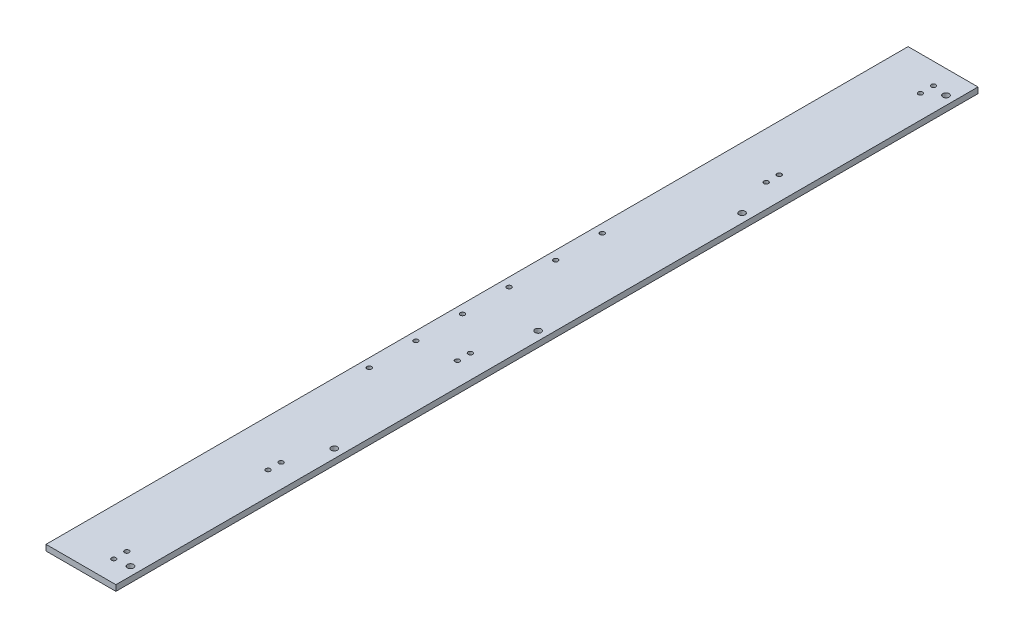
ISO-10303-21;
HEADER;
FILE_DESCRIPTION(('STEP AP214'),'2;1');
FILE_NAME('part.step','',(''),(''),'','','');
FILE_SCHEMA(('AUTOMOTIVE_DESIGN { 1 0 10303 214 1 1 1 1 }'));
ENDSEC;
DATA;
#1=APPLICATION_CONTEXT('core data for automotive mechanical design processes');
#2=APPLICATION_PROTOCOL_DEFINITION('international standard','automotive_design',2000,#1);
#3=PRODUCT_CONTEXT('',#1,'mechanical');
#4=PRODUCT('Part','Part','',(#3));
#5=PRODUCT_RELATED_PRODUCT_CATEGORY('part','',(#4));
#6=PRODUCT_DEFINITION_FORMATION('','',#4);
#7=PRODUCT_DEFINITION_CONTEXT('part definition',#1,'design');
#8=PRODUCT_DEFINITION('design','',#6,#7);
#9=PRODUCT_DEFINITION_SHAPE('','',#8);
#10=(LENGTH_UNIT() NAMED_UNIT(*) SI_UNIT(.MILLI.,.METRE.));
#11=(NAMED_UNIT(*) PLANE_ANGLE_UNIT() SI_UNIT($,.RADIAN.));
#12=(NAMED_UNIT(*) SI_UNIT($,.STERADIAN.) SOLID_ANGLE_UNIT());
#13=UNCERTAINTY_MEASURE_WITH_UNIT(LENGTH_MEASURE(1.E-05),#10,'distance_accuracy_value','');
#14=(GEOMETRIC_REPRESENTATION_CONTEXT(3) GLOBAL_UNCERTAINTY_ASSIGNED_CONTEXT((#13)) GLOBAL_UNIT_ASSIGNED_CONTEXT((#10,
#11,#12)) REPRESENTATION_CONTEXT('',''));
#15=CARTESIAN_POINT('',(0.,0.,0.));
#16=DIRECTION('',(0.,0.,1.));
#17=DIRECTION('',(1.,0.,0.));
#18=AXIS2_PLACEMENT_3D('',#15,#16,#17);
#19=CARTESIAN_POINT('',(9.525,0.,342.9));
#20=DIRECTION('',(0.,1.,0.));
#21=DIRECTION('',(0.,0.,1.));
#22=AXIS2_PLACEMENT_3D('',#19,#20,#21);
#23=CYLINDRICAL_SURFACE('',#22,2.4638);
#24=CARTESIAN_POINT('',(9.525,0.,342.9));
#25=DIRECTION('',(0.,1.,0.));
#26=DIRECTION('',(0.,0.,1.));
#27=AXIS2_PLACEMENT_3D('',#24,#25,#26);
#28=CIRCLE('',#27,2.4638);
#29=CARTESIAN_POINT('',(9.525,0.,345.3638));
#30=VERTEX_POINT('',#29);
#31=EDGE_CURVE('E46',#30,#30,#28,.T.);
#32=ORIENTED_EDGE('',*,*,#31,.F.);
#33=EDGE_LOOP('',(#32));
#34=FACE_BOUND('',#33,.T.);
#35=CARTESIAN_POINT('',(9.525,6.35,342.9));
#36=DIRECTION('',(0.,1.,0.));
#37=DIRECTION('',(0.,0.,1.));
#38=AXIS2_PLACEMENT_3D('',#35,#36,#37);
#39=CIRCLE('',#38,2.4638);
#40=CARTESIAN_POINT('',(9.525,6.35,345.3638));
#41=VERTEX_POINT('',#40);
#42=EDGE_CURVE('E11',#41,#41,#39,.T.);
#43=ORIENTED_EDGE('',*,*,#42,.T.);
#44=EDGE_LOOP('',(#43));
#45=FACE_BOUND('',#44,.T.);
#46=ADVANCED_FACE('F37',(#34,#45),#23,.F.);
#47=CARTESIAN_POINT('',(9.525,0.,393.7));
#48=DIRECTION('',(0.,1.,0.));
#49=DIRECTION('',(0.,0.,1.));
#50=AXIS2_PLACEMENT_3D('',#47,#48,#49);
#51=CYLINDRICAL_SURFACE('',#50,2.4638);
#52=CARTESIAN_POINT('',(9.525,0.,393.7));
#53=DIRECTION('',(0.,1.,0.));
#54=DIRECTION('',(0.,0.,1.));
#55=AXIS2_PLACEMENT_3D('',#52,#53,#54);
#56=CIRCLE('',#55,2.4638);
#57=CARTESIAN_POINT('',(9.525,0.,396.1638));
#58=VERTEX_POINT('',#57);
#59=EDGE_CURVE('E129',#58,#58,#56,.T.);
#60=ORIENTED_EDGE('',*,*,#59,.F.);
#61=EDGE_LOOP('',(#60));
#62=FACE_BOUND('',#61,.T.);
#63=CARTESIAN_POINT('',(9.525,6.35,393.7));
#64=DIRECTION('',(0.,1.,0.));
#65=DIRECTION('',(0.,0.,1.));
#66=AXIS2_PLACEMENT_3D('',#63,#64,#65);
#67=CIRCLE('',#66,2.4638);
#68=CARTESIAN_POINT('',(9.525,6.35,396.1638));
#69=VERTEX_POINT('',#68);
#70=EDGE_CURVE('E132',#69,#69,#67,.T.);
#71=ORIENTED_EDGE('',*,*,#70,.T.);
#72=EDGE_LOOP('',(#71));
#73=FACE_BOUND('',#72,.T.);
#74=ADVANCED_FACE('F228',(#62,#73),#51,.F.);
#75=CARTESIAN_POINT('',(9.525,0.,444.5));
#76=DIRECTION('',(0.,1.,0.));
#77=DIRECTION('',(0.,0.,1.));
#78=AXIS2_PLACEMENT_3D('',#75,#76,#77);
#79=CYLINDRICAL_SURFACE('',#78,2.4638);
#80=CARTESIAN_POINT('',(9.525,0.,444.5));
#81=DIRECTION('',(0.,1.,0.));
#82=DIRECTION('',(0.,0.,1.));
#83=AXIS2_PLACEMENT_3D('',#80,#81,#82);
#84=CIRCLE('',#83,2.4638);
#85=CARTESIAN_POINT('',(9.525,0.,446.9638));
#86=VERTEX_POINT('',#85);
#87=EDGE_CURVE('E123',#86,#86,#84,.T.);
#88=ORIENTED_EDGE('',*,*,#87,.F.);
#89=EDGE_LOOP('',(#88));
#90=FACE_BOUND('',#89,.T.);
#91=CARTESIAN_POINT('',(9.525,6.35,444.5));
#92=DIRECTION('',(0.,1.,0.));
#93=DIRECTION('',(0.,0.,1.));
#94=AXIS2_PLACEMENT_3D('',#91,#92,#93);
#95=CIRCLE('',#94,2.4638);
#96=CARTESIAN_POINT('',(9.525,6.35,446.9638));
#97=VERTEX_POINT('',#96);
#98=EDGE_CURVE('E126',#97,#97,#95,.T.);
#99=ORIENTED_EDGE('',*,*,#98,.T.);
#100=EDGE_LOOP('',(#99));
#101=FACE_BOUND('',#100,.T.);
#102=ADVANCED_FACE('F233',(#90,#101),#79,.F.);
#103=CARTESIAN_POINT('',(9.525,0.,495.3));
#104=DIRECTION('',(0.,1.,0.));
#105=DIRECTION('',(0.,0.,1.));
#106=AXIS2_PLACEMENT_3D('',#103,#104,#105);
#107=CYLINDRICAL_SURFACE('',#106,2.4638);
#108=CARTESIAN_POINT('',(9.525,0.,495.3));
#109=DIRECTION('',(0.,1.,0.));
#110=DIRECTION('',(0.,0.,1.));
#111=AXIS2_PLACEMENT_3D('',#108,#109,#110);
#112=CIRCLE('',#111,2.4638);
#113=CARTESIAN_POINT('',(9.525,0.,497.7638));
#114=VERTEX_POINT('',#113);
#115=EDGE_CURVE('E117',#114,#114,#112,.T.);
#116=ORIENTED_EDGE('',*,*,#115,.F.);
#117=EDGE_LOOP('',(#116));
#118=FACE_BOUND('',#117,.T.);
#119=CARTESIAN_POINT('',(9.525,6.35,495.3));
#120=DIRECTION('',(0.,1.,0.));
#121=DIRECTION('',(0.,0.,1.));
#122=AXIS2_PLACEMENT_3D('',#119,#120,#121);
#123=CIRCLE('',#122,2.4638);
#124=CARTESIAN_POINT('',(9.525,6.35,497.7638));
#125=VERTEX_POINT('',#124);
#126=EDGE_CURVE('E120',#125,#125,#123,.T.);
#127=ORIENTED_EDGE('',*,*,#126,.T.);
#128=EDGE_LOOP('',(#127));
#129=FACE_BOUND('',#128,.T.);
#130=ADVANCED_FACE('F246',(#118,#129),#107,.F.);
#131=CARTESIAN_POINT('',(0.,0.,939.8));
#132=DIRECTION('',(1.,0.,0.));
#133=DIRECTION('',(0.,0.,-1.));
#134=AXIS2_PLACEMENT_3D('',#131,#132,#133);
#135=PLANE('',#134);
#136=DIRECTION('',(0.,-1.,0.));
#137=VECTOR('',#136,1.);
#138=CARTESIAN_POINT('',(0.,0.,0.));
#139=LINE('',#138,#137);
#140=CARTESIAN_POINT('',(0.,6.35,0.));
#141=VERTEX_POINT('',#140);
#142=CARTESIAN_POINT('',(0.,0.,0.));
#143=VERTEX_POINT('',#142);
#144=EDGE_CURVE('E107',#141,#143,#139,.T.);
#145=ORIENTED_EDGE('',*,*,#144,.T.);
#146=DIRECTION('',(0.,0.,-1.));
#147=VECTOR('',#146,1.);
#148=CARTESIAN_POINT('',(0.,0.,939.8));
#149=LINE('',#148,#147);
#150=CARTESIAN_POINT('',(0.,0.,939.8));
#151=VERTEX_POINT('',#150);
#152=EDGE_CURVE('E98',#151,#143,#149,.T.);
#153=ORIENTED_EDGE('',*,*,#152,.F.);
#154=DIRECTION('',(0.,-1.,0.));
#155=VECTOR('',#154,1.);
#156=CARTESIAN_POINT('',(0.,0.,939.8));
#157=LINE('',#156,#155);
#158=CARTESIAN_POINT('',(0.,6.35,939.8));
#159=VERTEX_POINT('',#158);
#160=EDGE_CURVE('E91',#159,#151,#157,.T.);
#161=ORIENTED_EDGE('',*,*,#160,.F.);
#162=DIRECTION('',(0.,0.,-1.));
#163=VECTOR('',#162,1.);
#164=CARTESIAN_POINT('',(0.,6.35,939.8));
#165=LINE('',#164,#163);
#166=EDGE_CURVE('E103',#159,#141,#165,.T.);
#167=ORIENTED_EDGE('',*,*,#166,.T.);
#168=EDGE_LOOP('',(#145,#153,#161,#167));
#169=FACE_BOUND('',#168,.T.);
#170=ADVANCED_FACE('F238',(#169),#135,.F.);
#171=CARTESIAN_POINT('',(0.,0.,939.8));
#172=DIRECTION('',(0.,1.,0.));
#173=DIRECTION('',(0.,0.,1.));
#174=AXIS2_PLACEMENT_3D('',#171,#172,#173);
#175=PLANE('',#174);
#176=CARTESIAN_POINT('',(66.6750000000046,0.,914.4));
#177=DIRECTION('',(0.,1.,0.));
#178=DIRECTION('',(0.,0.,1.));
#179=AXIS2_PLACEMENT_3D('',#176,#177,#178);
#180=CIRCLE('',#179,3.3655);
#181=CARTESIAN_POINT('',(66.6750000000046,0.,917.7655));
#182=VERTEX_POINT('',#181);
#183=EDGE_CURVE('E489',#182,#182,#180,.T.);
#184=ORIENTED_EDGE('',*,*,#183,.T.);
#185=EDGE_LOOP('',(#184));
#186=FACE_BOUND('',#185,.T.);
#187=CARTESIAN_POINT('',(66.6750000000022,0.,692.15));
#188=DIRECTION('',(0.,1.,0.));
#189=DIRECTION('',(0.,0.,1.));
#190=AXIS2_PLACEMENT_3D('',#187,#188,#189);
#191=CIRCLE('',#190,3.3655);
#192=CARTESIAN_POINT('',(66.6750000000022,0.,695.5155));
#193=VERTEX_POINT('',#192);
#194=EDGE_CURVE('E490',#193,#193,#191,.T.);
#195=ORIENTED_EDGE('',*,*,#194,.T.);
#196=EDGE_LOOP('',(#195));
#197=FACE_BOUND('',#196,.T.);
#198=CARTESIAN_POINT('',(66.6749999999984,0.,25.4));
#199=DIRECTION('',(0.,1.,0.));
#200=DIRECTION('',(0.,0.,1.));
#201=AXIS2_PLACEMENT_3D('',#198,#199,#200);
#202=CIRCLE('',#201,3.36549999999999);
#203=CARTESIAN_POINT('',(66.6749999999984,0.,28.7655));
#204=VERTEX_POINT('',#203);
#205=EDGE_CURVE('E493',#204,#204,#202,.T.);
#206=ORIENTED_EDGE('',*,*,#205,.T.);
#207=EDGE_LOOP('',(#206));
#208=FACE_BOUND('',#207,.T.);
#209=CARTESIAN_POINT('',(66.6749999999991,0.,247.65));
#210=DIRECTION('',(0.,1.,0.));
#211=DIRECTION('',(0.,0.,1.));
#212=AXIS2_PLACEMENT_3D('',#209,#210,#211);
#213=CIRCLE('',#212,3.36549999999999);
#214=CARTESIAN_POINT('',(66.6749999999991,0.,251.0155));
#215=VERTEX_POINT('',#214);
#216=EDGE_CURVE('E499',#215,#215,#213,.T.);
#217=ORIENTED_EDGE('',*,*,#216,.T.);
#218=EDGE_LOOP('',(#217));
#219=FACE_BOUND('',#218,.T.);
#220=CARTESIAN_POINT('',(66.6749999999999,0.,469.9));
#221=DIRECTION('',(0.,1.,0.));
#222=DIRECTION('',(0.,0.,1.));
#223=AXIS2_PLACEMENT_3D('',#220,#221,#222);
#224=CIRCLE('',#223,3.3655);
#225=CARTESIAN_POINT('',(66.6749999999999,0.,473.2655));
#226=VERTEX_POINT('',#225);
#227=EDGE_CURVE('E141',#226,#226,#224,.T.);
#228=ORIENTED_EDGE('',*,*,#227,.T.);
#229=EDGE_LOOP('',(#228));
#230=FACE_BOUND('',#229,.T.);
#231=CARTESIAN_POINT('',(50.8,0.,23.114));
#232=DIRECTION('',(0.,-1.,0.));
#233=DIRECTION('',(0.,0.,-1.));
#234=AXIS2_PLACEMENT_3D('',#231,#232,#233);
#235=CIRCLE('',#234,2.4638);
#236=CARTESIAN_POINT('',(50.8,0.,20.6502));
#237=VERTEX_POINT('',#236);
#238=EDGE_CURVE('E189',#237,#237,#235,.T.);
#239=ORIENTED_EDGE('',*,*,#238,.F.);
#240=EDGE_LOOP('',(#239));
#241=FACE_BOUND('',#240,.T.);
#242=CARTESIAN_POINT('',(50.8,0.,37.338));
#243=DIRECTION('',(0.,-1.,0.));
#244=DIRECTION('',(0.,0.,-1.));
#245=AXIS2_PLACEMENT_3D('',#242,#243,#244);
#246=CIRCLE('',#245,2.4638);
#247=CARTESIAN_POINT('',(50.8,0.,34.8742));
#248=VERTEX_POINT('',#247);
#249=EDGE_CURVE('E505',#248,#248,#246,.T.);
#250=ORIENTED_EDGE('',*,*,#249,.F.);
#251=EDGE_LOOP('',(#250));
#252=FACE_BOUND('',#251,.T.);
#253=CARTESIAN_POINT('',(50.8,0.,191.262));
#254=DIRECTION('',(0.,-1.,0.));
#255=DIRECTION('',(0.,0.,-1.));
#256=AXIS2_PLACEMENT_3D('',#253,#254,#255);
#257=CIRCLE('',#256,2.4638);
#258=CARTESIAN_POINT('',(50.8,0.,188.7982));
#259=VERTEX_POINT('',#258);
#260=EDGE_CURVE('E511',#259,#259,#257,.T.);
#261=ORIENTED_EDGE('',*,*,#260,.F.);
#262=EDGE_LOOP('',(#261));
#263=FACE_BOUND('',#262,.T.);
#264=CARTESIAN_POINT('',(50.8,0.,205.486));
#265=DIRECTION('',(0.,-1.,0.));
#266=DIRECTION('',(0.,0.,-1.));
#267=AXIS2_PLACEMENT_3D('',#264,#265,#266);
#268=CIRCLE('',#267,2.4638);
#269=CARTESIAN_POINT('',(50.8,0.,203.0222));
#270=VERTEX_POINT('',#269);
#271=EDGE_CURVE('E155',#270,#270,#268,.T.);
#272=ORIENTED_EDGE('',*,*,#271,.F.);
#273=EDGE_LOOP('',(#272));
#274=FACE_BOUND('',#273,.T.);
#275=CARTESIAN_POINT('',(50.8,0.,916.686));
#276=DIRECTION('',(0.,1.,0.));
#277=DIRECTION('',(0.,0.,1.));
#278=AXIS2_PLACEMENT_3D('',#275,#276,#277);
#279=CIRCLE('',#278,2.4638);
#280=CARTESIAN_POINT('',(50.8,0.,919.1498));
#281=VERTEX_POINT('',#280);
#282=EDGE_CURVE('E164',#281,#281,#279,.T.);
#283=ORIENTED_EDGE('',*,*,#282,.T.);
#284=EDGE_LOOP('',(#283));
#285=FACE_BOUND('',#284,.T.);
#286=CARTESIAN_POINT('',(50.8,0.,902.462));
#287=DIRECTION('',(0.,1.,0.));
#288=DIRECTION('',(0.,0.,1.));
#289=AXIS2_PLACEMENT_3D('',#286,#287,#288);
#290=CIRCLE('',#289,2.4638);
#291=CARTESIAN_POINT('',(50.8,0.,904.9258));
#292=VERTEX_POINT('',#291);
#293=EDGE_CURVE('E171',#292,#292,#290,.T.);
#294=ORIENTED_EDGE('',*,*,#293,.T.);
#295=EDGE_LOOP('',(#294));
#296=FACE_BOUND('',#295,.T.);
#297=CARTESIAN_POINT('',(50.8,0.,748.538));
#298=DIRECTION('',(0.,1.,0.));
#299=DIRECTION('',(0.,0.,1.));
#300=AXIS2_PLACEMENT_3D('',#297,#298,#299);
#301=CIRCLE('',#300,2.4638);
#302=CARTESIAN_POINT('',(50.8,0.,751.0018));
#303=VERTEX_POINT('',#302);
#304=EDGE_CURVE('E177',#303,#303,#301,.T.);
#305=ORIENTED_EDGE('',*,*,#304,.T.);
#306=EDGE_LOOP('',(#305));
#307=FACE_BOUND('',#306,.T.);
#308=CARTESIAN_POINT('',(50.8,0.,734.314));
#309=DIRECTION('',(0.,1.,0.));
#310=DIRECTION('',(0.,0.,1.));
#311=AXIS2_PLACEMENT_3D('',#308,#309,#310);
#312=CIRCLE('',#311,2.4638);
#313=CARTESIAN_POINT('',(50.8,0.,736.7778));
#314=VERTEX_POINT('',#313);
#315=EDGE_CURVE('E183',#314,#314,#312,.T.);
#316=ORIENTED_EDGE('',*,*,#315,.T.);
#317=EDGE_LOOP('',(#316));
#318=FACE_BOUND('',#317,.T.);
#319=CARTESIAN_POINT('',(50.8,0.,527.939));
#320=DIRECTION('',(0.,1.,0.));
#321=DIRECTION('',(0.,0.,1.));
#322=AXIS2_PLACEMENT_3D('',#319,#320,#321);
#323=CIRCLE('',#322,2.4638);
#324=CARTESIAN_POINT('',(50.8,0.,530.4028));
#325=VERTEX_POINT('',#324);
#326=EDGE_CURVE('E190',#325,#325,#323,.T.);
#327=ORIENTED_EDGE('',*,*,#326,.T.);
#328=EDGE_LOOP('',(#327));
#329=FACE_BOUND('',#328,.T.);
#330=CARTESIAN_POINT('',(50.8,0.,542.163));
#331=DIRECTION('',(0.,1.,0.));
#332=DIRECTION('',(0.,0.,1.));
#333=AXIS2_PLACEMENT_3D('',#330,#331,#332);
#334=CIRCLE('',#333,2.4638);
#335=CARTESIAN_POINT('',(50.8,0.,544.6268));
#336=VERTEX_POINT('',#335);
#337=EDGE_CURVE('E197',#336,#336,#334,.T.);
#338=ORIENTED_EDGE('',*,*,#337,.T.);
#339=EDGE_LOOP('',(#338));
#340=FACE_BOUND('',#339,.T.);
#341=CARTESIAN_POINT('',(9.525,0.,546.1));
#342=DIRECTION('',(0.,1.,0.));
#343=DIRECTION('',(0.,0.,1.));
#344=AXIS2_PLACEMENT_3D('',#341,#342,#343);
#345=CIRCLE('',#344,2.4638);
#346=CARTESIAN_POINT('',(9.525,0.,548.5638));
#347=VERTEX_POINT('',#346);
#348=EDGE_CURVE('E193',#347,#347,#345,.T.);
#349=ORIENTED_EDGE('',*,*,#348,.T.);
#350=EDGE_LOOP('',(#349));
#351=FACE_BOUND('',#350,.T.);
#352=CARTESIAN_POINT('',(9.525,0.,596.9));
#353=DIRECTION('',(0.,1.,0.));
#354=DIRECTION('',(0.,0.,1.));
#355=AXIS2_PLACEMENT_3D('',#352,#353,#354);
#356=CIRCLE('',#355,2.4638);
#357=CARTESIAN_POINT('',(9.525,0.,599.3638));
#358=VERTEX_POINT('',#357);
#359=EDGE_CURVE('E110',#358,#358,#356,.T.);
#360=ORIENTED_EDGE('',*,*,#359,.T.);
#361=EDGE_LOOP('',(#360));
#362=FACE_BOUND('',#361,.T.);
#363=DIRECTION('',(1.,0.,0.));
#364=VECTOR('',#363,1.);
#365=CARTESIAN_POINT('',(0.,0.,0.));
#366=LINE('',#365,#364);
#367=CARTESIAN_POINT('',(76.2,0.,0.));
#368=VERTEX_POINT('',#367);
#369=EDGE_CURVE('E97',#143,#368,#366,.T.);
#370=ORIENTED_EDGE('',*,*,#369,.T.);
#371=DIRECTION('',(0.,0.,-1.));
#372=VECTOR('',#371,1.);
#373=CARTESIAN_POINT('',(76.2,0.,939.8));
#374=LINE('',#373,#372);
#375=CARTESIAN_POINT('',(76.2,0.,939.8));
#376=VERTEX_POINT('',#375);
#377=EDGE_CURVE('E94',#376,#368,#374,.T.);
#378=ORIENTED_EDGE('',*,*,#377,.F.);
#379=DIRECTION('',(1.,0.,0.));
#380=VECTOR('',#379,1.);
#381=CARTESIAN_POINT('',(0.,0.,939.8));
#382=LINE('',#381,#380);
#383=EDGE_CURVE('E86',#151,#376,#382,.T.);
#384=ORIENTED_EDGE('',*,*,#383,.F.);
#385=ORIENTED_EDGE('',*,*,#152,.T.);
#386=EDGE_LOOP('',(#370,#378,#384,#385));
#387=FACE_BOUND('',#386,.T.);
#388=ORIENTED_EDGE('',*,*,#115,.T.);
#389=EDGE_LOOP('',(#388));
#390=FACE_BOUND('',#389,.T.);
#391=ORIENTED_EDGE('',*,*,#87,.T.);
#392=EDGE_LOOP('',(#391));
#393=FACE_BOUND('',#392,.T.);
#394=ORIENTED_EDGE('',*,*,#59,.T.);
#395=EDGE_LOOP('',(#394));
#396=FACE_BOUND('',#395,.T.);
#397=ORIENTED_EDGE('',*,*,#31,.T.);
#398=EDGE_LOOP('',(#397));
#399=FACE_BOUND('',#398,.T.);
#400=ADVANCED_FACE('F95',(#186,#197,#208,#219,#230,#241,#252,#263,#274,#285,#296,#307,#318,#329,
#340,#351,#362,#387,#390,#393,#396,#399),#175,.F.);
#401=CARTESIAN_POINT('',(76.2,0.,939.8));
#402=DIRECTION('',(-1.,0.,0.));
#403=DIRECTION('',(0.,0.,1.));
#404=AXIS2_PLACEMENT_3D('',#401,#402,#403);
#405=PLANE('',#404);
#406=DIRECTION('',(0.,1.,0.));
#407=VECTOR('',#406,1.);
#408=CARTESIAN_POINT('',(76.2,0.,0.));
#409=LINE('',#408,#407);
#410=CARTESIAN_POINT('',(76.2,6.35,0.));
#411=VERTEX_POINT('',#410);
#412=EDGE_CURVE('E72',#368,#411,#409,.T.);
#413=ORIENTED_EDGE('',*,*,#412,.T.);
#414=DIRECTION('',(0.,0.,-1.));
#415=VECTOR('',#414,1.);
#416=CARTESIAN_POINT('',(76.2,6.35,939.8));
#417=LINE('',#416,#415);
#418=CARTESIAN_POINT('',(76.2,6.35,939.8));
#419=VERTEX_POINT('',#418);
#420=EDGE_CURVE('E99',#419,#411,#417,.T.);
#421=ORIENTED_EDGE('',*,*,#420,.F.);
#422=DIRECTION('',(0.,1.,0.));
#423=VECTOR('',#422,1.);
#424=CARTESIAN_POINT('',(76.2,0.,939.8));
#425=LINE('',#424,#423);
#426=EDGE_CURVE('E89',#376,#419,#425,.T.);
#427=ORIENTED_EDGE('',*,*,#426,.F.);
#428=ORIENTED_EDGE('',*,*,#377,.T.);
#429=EDGE_LOOP('',(#413,#421,#427,#428));
#430=FACE_BOUND('',#429,.T.);
#431=ADVANCED_FACE('F101',(#430),#405,.F.);
#432=CARTESIAN_POINT('',(0.,6.35,939.8));
#433=DIRECTION('',(0.,-1.,0.));
#434=DIRECTION('',(0.,0.,-1.));
#435=AXIS2_PLACEMENT_3D('',#432,#433,#434);
#436=PLANE('',#435);
#437=CARTESIAN_POINT('',(66.6750000000046,6.35,914.4));
#438=DIRECTION('',(0.,-1.,0.));
#439=DIRECTION('',(0.,0.,-1.));
#440=AXIS2_PLACEMENT_3D('',#437,#438,#439);
#441=CIRCLE('',#440,3.3655);
#442=CARTESIAN_POINT('',(66.6750000000046,6.35,911.0345));
#443=VERTEX_POINT('',#442);
#444=EDGE_CURVE('E40',#443,#443,#441,.T.);
#445=ORIENTED_EDGE('',*,*,#444,.T.);
#446=EDGE_LOOP('',(#445));
#447=FACE_BOUND('',#446,.T.);
#448=CARTESIAN_POINT('',(66.6750000000022,6.35,692.15));
#449=DIRECTION('',(0.,-1.,0.));
#450=DIRECTION('',(0.,0.,-1.));
#451=AXIS2_PLACEMENT_3D('',#448,#449,#450);
#452=CIRCLE('',#451,3.3655);
#453=CARTESIAN_POINT('',(66.6750000000022,6.35,688.7845));
#454=VERTEX_POINT('',#453);
#455=EDGE_CURVE('E146',#454,#454,#452,.T.);
#456=ORIENTED_EDGE('',*,*,#455,.T.);
#457=EDGE_LOOP('',(#456));
#458=FACE_BOUND('',#457,.T.);
#459=CARTESIAN_POINT('',(66.6749999999984,6.35,25.4));
#460=DIRECTION('',(0.,-1.,0.));
#461=DIRECTION('',(0.,0.,-1.));
#462=AXIS2_PLACEMENT_3D('',#459,#460,#461);
#463=CIRCLE('',#462,3.36549999999999);
#464=CARTESIAN_POINT('',(66.6749999999984,6.35,22.0345));
#465=VERTEX_POINT('',#464);
#466=EDGE_CURVE('E144',#465,#465,#463,.T.);
#467=ORIENTED_EDGE('',*,*,#466,.T.);
#468=EDGE_LOOP('',(#467));
#469=FACE_BOUND('',#468,.T.);
#470=CARTESIAN_POINT('',(66.6749999999991,6.35,247.65));
#471=DIRECTION('',(0.,-1.,0.));
#472=DIRECTION('',(0.,0.,-1.));
#473=AXIS2_PLACEMENT_3D('',#470,#471,#472);
#474=CIRCLE('',#473,3.36549999999999);
#475=CARTESIAN_POINT('',(66.6749999999991,6.35,244.2845));
#476=VERTEX_POINT('',#475);
#477=EDGE_CURVE('E140',#476,#476,#474,.T.);
#478=ORIENTED_EDGE('',*,*,#477,.T.);
#479=EDGE_LOOP('',(#478));
#480=FACE_BOUND('',#479,.T.);
#481=CARTESIAN_POINT('',(66.6749999999999,6.35,469.9));
#482=DIRECTION('',(0.,-1.,0.));
#483=DIRECTION('',(0.,0.,-1.));
#484=AXIS2_PLACEMENT_3D('',#481,#482,#483);
#485=CIRCLE('',#484,3.3655);
#486=CARTESIAN_POINT('',(66.6749999999999,6.35,466.5345));
#487=VERTEX_POINT('',#486);
#488=EDGE_CURVE('E137',#487,#487,#485,.T.);
#489=ORIENTED_EDGE('',*,*,#488,.T.);
#490=EDGE_LOOP('',(#489));
#491=FACE_BOUND('',#490,.T.);
#492=CARTESIAN_POINT('',(50.8,6.35,23.114));
#493=DIRECTION('',(0.,-1.,0.));
#494=DIRECTION('',(0.,0.,-1.));
#495=AXIS2_PLACEMENT_3D('',#492,#493,#494);
#496=CIRCLE('',#495,2.4638);
#497=CARTESIAN_POINT('',(50.8,6.35,20.6502));
#498=VERTEX_POINT('',#497);
#499=EDGE_CURVE('E502',#498,#498,#496,.T.);
#500=ORIENTED_EDGE('',*,*,#499,.T.);
#501=EDGE_LOOP('',(#500));
#502=FACE_BOUND('',#501,.T.);
#503=CARTESIAN_POINT('',(50.8,6.35,37.338));
#504=DIRECTION('',(0.,-1.,0.));
#505=DIRECTION('',(0.,0.,-1.));
#506=AXIS2_PLACEMENT_3D('',#503,#504,#505);
#507=CIRCLE('',#506,2.4638);
#508=CARTESIAN_POINT('',(50.8,6.35,34.8742));
#509=VERTEX_POINT('',#508);
#510=EDGE_CURVE('E508',#509,#509,#507,.T.);
#511=ORIENTED_EDGE('',*,*,#510,.T.);
#512=EDGE_LOOP('',(#511));
#513=FACE_BOUND('',#512,.T.);
#514=CARTESIAN_POINT('',(50.8,6.35,191.262));
#515=DIRECTION('',(0.,-1.,0.));
#516=DIRECTION('',(0.,0.,-1.));
#517=AXIS2_PLACEMENT_3D('',#514,#515,#516);
#518=CIRCLE('',#517,2.4638);
#519=CARTESIAN_POINT('',(50.8,6.35,188.7982));
#520=VERTEX_POINT('',#519);
#521=EDGE_CURVE('E160',#520,#520,#518,.T.);
#522=ORIENTED_EDGE('',*,*,#521,.T.);
#523=EDGE_LOOP('',(#522));
#524=FACE_BOUND('',#523,.T.);
#525=CARTESIAN_POINT('',(50.8,6.35,205.486));
#526=DIRECTION('',(0.,-1.,0.));
#527=DIRECTION('',(0.,0.,-1.));
#528=AXIS2_PLACEMENT_3D('',#525,#526,#527);
#529=CIRCLE('',#528,2.4638);
#530=CARTESIAN_POINT('',(50.8,6.35,203.0222));
#531=VERTEX_POINT('',#530);
#532=EDGE_CURVE('E151',#531,#531,#529,.T.);
#533=ORIENTED_EDGE('',*,*,#532,.T.);
#534=EDGE_LOOP('',(#533));
#535=FACE_BOUND('',#534,.T.);
#536=CARTESIAN_POINT('',(50.8,6.35,916.686));
#537=DIRECTION('',(0.,1.,0.));
#538=DIRECTION('',(0.,0.,1.));
#539=AXIS2_PLACEMENT_3D('',#536,#537,#538);
#540=CIRCLE('',#539,2.4638);
#541=CARTESIAN_POINT('',(50.8,6.35,919.1498));
#542=VERTEX_POINT('',#541);
#543=EDGE_CURVE('E168',#542,#542,#540,.T.);
#544=ORIENTED_EDGE('',*,*,#543,.F.);
#545=EDGE_LOOP('',(#544));
#546=FACE_BOUND('',#545,.T.);
#547=CARTESIAN_POINT('',(50.8,6.35,902.462));
#548=DIRECTION('',(0.,1.,0.));
#549=DIRECTION('',(0.,0.,1.));
#550=AXIS2_PLACEMENT_3D('',#547,#548,#549);
#551=CIRCLE('',#550,2.4638);
#552=CARTESIAN_POINT('',(50.8,6.35,904.9258));
#553=VERTEX_POINT('',#552);
#554=EDGE_CURVE('E174',#553,#553,#551,.T.);
#555=ORIENTED_EDGE('',*,*,#554,.F.);
#556=EDGE_LOOP('',(#555));
#557=FACE_BOUND('',#556,.T.);
#558=CARTESIAN_POINT('',(50.8,6.35,748.538));
#559=DIRECTION('',(0.,1.,0.));
#560=DIRECTION('',(0.,0.,1.));
#561=AXIS2_PLACEMENT_3D('',#558,#559,#560);
#562=CIRCLE('',#561,2.4638);
#563=CARTESIAN_POINT('',(50.8,6.35,751.0018));
#564=VERTEX_POINT('',#563);
#565=EDGE_CURVE('E180',#564,#564,#562,.T.);
#566=ORIENTED_EDGE('',*,*,#565,.F.);
#567=EDGE_LOOP('',(#566));
#568=FACE_BOUND('',#567,.T.);
#569=CARTESIAN_POINT('',(50.8,6.35,734.314));
#570=DIRECTION('',(0.,1.,0.));
#571=DIRECTION('',(0.,0.,1.));
#572=AXIS2_PLACEMENT_3D('',#569,#570,#571);
#573=CIRCLE('',#572,2.4638);
#574=CARTESIAN_POINT('',(50.8,6.35,736.7778));
#575=VERTEX_POINT('',#574);
#576=EDGE_CURVE('E186',#575,#575,#573,.T.);
#577=ORIENTED_EDGE('',*,*,#576,.F.);
#578=EDGE_LOOP('',(#577));
#579=FACE_BOUND('',#578,.T.);
#580=CARTESIAN_POINT('',(50.8,6.35,527.939));
#581=DIRECTION('',(0.,1.,0.));
#582=DIRECTION('',(0.,0.,1.));
#583=AXIS2_PLACEMENT_3D('',#580,#581,#582);
#584=CIRCLE('',#583,2.4638);
#585=CARTESIAN_POINT('',(50.8,6.35,530.4028));
#586=VERTEX_POINT('',#585);
#587=EDGE_CURVE('E194',#586,#586,#584,.T.);
#588=ORIENTED_EDGE('',*,*,#587,.F.);
#589=EDGE_LOOP('',(#588));
#590=FACE_BOUND('',#589,.T.);
#591=CARTESIAN_POINT('',(50.8,6.35,542.163));
#592=DIRECTION('',(0.,1.,0.));
#593=DIRECTION('',(0.,0.,1.));
#594=AXIS2_PLACEMENT_3D('',#591,#592,#593);
#595=CIRCLE('',#594,2.4638);
#596=CARTESIAN_POINT('',(50.8,6.35,544.6268));
#597=VERTEX_POINT('',#596);
#598=EDGE_CURVE('E167',#597,#597,#595,.T.);
#599=ORIENTED_EDGE('',*,*,#598,.F.);
#600=EDGE_LOOP('',(#599));
#601=FACE_BOUND('',#600,.T.);
#602=CARTESIAN_POINT('',(9.525,6.35,546.1));
#603=DIRECTION('',(0.,1.,0.));
#604=DIRECTION('',(0.,0.,1.));
#605=AXIS2_PLACEMENT_3D('',#602,#603,#604);
#606=CIRCLE('',#605,2.4638);
#607=CARTESIAN_POINT('',(9.525,6.35,548.5638));
#608=VERTEX_POINT('',#607);
#609=EDGE_CURVE('E204',#608,#608,#606,.T.);
#610=ORIENTED_EDGE('',*,*,#609,.F.);
#611=EDGE_LOOP('',(#610));
#612=FACE_BOUND('',#611,.T.);
#613=CARTESIAN_POINT('',(9.525,6.35,596.9));
#614=DIRECTION('',(0.,1.,0.));
#615=DIRECTION('',(0.,0.,1.));
#616=AXIS2_PLACEMENT_3D('',#613,#614,#615);
#617=CIRCLE('',#616,2.4638);
#618=CARTESIAN_POINT('',(9.525,6.35,599.3638));
#619=VERTEX_POINT('',#618);
#620=EDGE_CURVE('E207',#619,#619,#617,.T.);
#621=ORIENTED_EDGE('',*,*,#620,.F.);
#622=EDGE_LOOP('',(#621));
#623=FACE_BOUND('',#622,.T.);
#624=DIRECTION('',(-1.,0.,0.));
#625=VECTOR('',#624,1.);
#626=CARTESIAN_POINT('',(0.,6.35,0.));
#627=LINE('',#626,#625);
#628=EDGE_CURVE('E78',#411,#141,#627,.T.);
#629=ORIENTED_EDGE('',*,*,#628,.T.);
#630=ORIENTED_EDGE('',*,*,#166,.F.);
#631=DIRECTION('',(-1.,0.,0.));
#632=VECTOR('',#631,1.);
#633=CARTESIAN_POINT('',(0.,6.35,939.8));
#634=LINE('',#633,#632);
#635=EDGE_CURVE('E55',#419,#159,#634,.T.);
#636=ORIENTED_EDGE('',*,*,#635,.F.);
#637=ORIENTED_EDGE('',*,*,#420,.T.);
#638=EDGE_LOOP('',(#629,#630,#636,#637));
#639=FACE_BOUND('',#638,.T.);
#640=ORIENTED_EDGE('',*,*,#126,.F.);
#641=EDGE_LOOP('',(#640));
#642=FACE_BOUND('',#641,.T.);
#643=ORIENTED_EDGE('',*,*,#98,.F.);
#644=EDGE_LOOP('',(#643));
#645=FACE_BOUND('',#644,.T.);
#646=ORIENTED_EDGE('',*,*,#70,.F.);
#647=EDGE_LOOP('',(#646));
#648=FACE_BOUND('',#647,.T.);
#649=ORIENTED_EDGE('',*,*,#42,.F.);
#650=EDGE_LOOP('',(#649));
#651=FACE_BOUND('',#650,.T.);
#652=ADVANCED_FACE('F215',(#447,#458,#469,#480,#491,#502,#513,#524,#535,#546,#557,#568,#579,
#590,#601,#612,#623,#639,#642,#645,#648,#651),#436,.F.);
#653=CARTESIAN_POINT('',(0.,0.,939.8));
#654=DIRECTION('',(0.,0.,-1.));
#655=DIRECTION('',(-1.,0.,0.));
#656=AXIS2_PLACEMENT_3D('',#653,#654,#655);
#657=PLANE('',#656);
#658=ORIENTED_EDGE('',*,*,#160,.T.);
#659=ORIENTED_EDGE('',*,*,#383,.T.);
#660=ORIENTED_EDGE('',*,*,#426,.T.);
#661=ORIENTED_EDGE('',*,*,#635,.T.);
#662=EDGE_LOOP('',(#658,#659,#660,#661));
#663=FACE_BOUND('',#662,.T.);
#664=ADVANCED_FACE('F87',(#663),#657,.F.);
#665=CARTESIAN_POINT('',(0.,0.,0.));
#666=DIRECTION('',(0.,0.,-1.));
#667=DIRECTION('',(-1.,0.,0.));
#668=AXIS2_PLACEMENT_3D('',#665,#666,#667);
#669=PLANE('',#668);
#670=ORIENTED_EDGE('',*,*,#144,.F.);
#671=ORIENTED_EDGE('',*,*,#628,.F.);
#672=ORIENTED_EDGE('',*,*,#412,.F.);
#673=ORIENTED_EDGE('',*,*,#369,.F.);
#674=EDGE_LOOP('',(#670,#671,#672,#673));
#675=FACE_BOUND('',#674,.T.);
#676=ADVANCED_FACE('F293',(#675),#669,.T.);
#677=CARTESIAN_POINT('',(9.525,0.,596.9));
#678=DIRECTION('',(0.,1.,0.));
#679=DIRECTION('',(0.,0.,1.));
#680=AXIS2_PLACEMENT_3D('',#677,#678,#679);
#681=CYLINDRICAL_SURFACE('',#680,2.4638);
#682=ORIENTED_EDGE('',*,*,#359,.F.);
#683=EDGE_LOOP('',(#682));
#684=FACE_BOUND('',#683,.T.);
#685=ORIENTED_EDGE('',*,*,#620,.T.);
#686=EDGE_LOOP('',(#685));
#687=FACE_BOUND('',#686,.T.);
#688=ADVANCED_FACE('F213',(#684,#687),#681,.F.);
#689=CARTESIAN_POINT('',(9.525,0.,546.1));
#690=DIRECTION('',(0.,1.,0.));
#691=DIRECTION('',(0.,0.,1.));
#692=AXIS2_PLACEMENT_3D('',#689,#690,#691);
#693=CYLINDRICAL_SURFACE('',#692,2.4638);
#694=ORIENTED_EDGE('',*,*,#348,.F.);
#695=EDGE_LOOP('',(#694));
#696=FACE_BOUND('',#695,.T.);
#697=ORIENTED_EDGE('',*,*,#609,.T.);
#698=EDGE_LOOP('',(#697));
#699=FACE_BOUND('',#698,.T.);
#700=ADVANCED_FACE('F310',(#696,#699),#693,.F.);
#701=CARTESIAN_POINT('',(50.8,0.,542.163));
#702=DIRECTION('',(0.,1.,0.));
#703=DIRECTION('',(0.,0.,1.));
#704=AXIS2_PLACEMENT_3D('',#701,#702,#703);
#705=CYLINDRICAL_SURFACE('',#704,2.4638);
#706=ORIENTED_EDGE('',*,*,#337,.F.);
#707=EDGE_LOOP('',(#706));
#708=FACE_BOUND('',#707,.T.);
#709=ORIENTED_EDGE('',*,*,#598,.T.);
#710=EDGE_LOOP('',(#709));
#711=FACE_BOUND('',#710,.T.);
#712=ADVANCED_FACE('F333',(#708,#711),#705,.F.);
#713=CARTESIAN_POINT('',(50.8,0.,527.939));
#714=DIRECTION('',(0.,1.,0.));
#715=DIRECTION('',(0.,0.,1.));
#716=AXIS2_PLACEMENT_3D('',#713,#714,#715);
#717=CYLINDRICAL_SURFACE('',#716,2.4638);
#718=ORIENTED_EDGE('',*,*,#326,.F.);
#719=EDGE_LOOP('',(#718));
#720=FACE_BOUND('',#719,.T.);
#721=ORIENTED_EDGE('',*,*,#587,.T.);
#722=EDGE_LOOP('',(#721));
#723=FACE_BOUND('',#722,.T.);
#724=ADVANCED_FACE('F342',(#720,#723),#717,.F.);
#725=CARTESIAN_POINT('',(50.8,0.,734.314));
#726=DIRECTION('',(0.,1.,0.));
#727=DIRECTION('',(0.,0.,1.));
#728=AXIS2_PLACEMENT_3D('',#725,#726,#727);
#729=CYLINDRICAL_SURFACE('',#728,2.4638);
#730=ORIENTED_EDGE('',*,*,#315,.F.);
#731=EDGE_LOOP('',(#730));
#732=FACE_BOUND('',#731,.T.);
#733=ORIENTED_EDGE('',*,*,#576,.T.);
#734=EDGE_LOOP('',(#733));
#735=FACE_BOUND('',#734,.T.);
#736=ADVANCED_FACE('F351',(#732,#735),#729,.F.);
#737=CARTESIAN_POINT('',(50.8,0.,748.538));
#738=DIRECTION('',(0.,1.,0.));
#739=DIRECTION('',(0.,0.,1.));
#740=AXIS2_PLACEMENT_3D('',#737,#738,#739);
#741=CYLINDRICAL_SURFACE('',#740,2.4638);
#742=ORIENTED_EDGE('',*,*,#304,.F.);
#743=EDGE_LOOP('',(#742));
#744=FACE_BOUND('',#743,.T.);
#745=ORIENTED_EDGE('',*,*,#565,.T.);
#746=EDGE_LOOP('',(#745));
#747=FACE_BOUND('',#746,.T.);
#748=ADVANCED_FACE('F360',(#744,#747),#741,.F.);
#749=CARTESIAN_POINT('',(50.8,0.,902.462));
#750=DIRECTION('',(0.,1.,0.));
#751=DIRECTION('',(0.,0.,1.));
#752=AXIS2_PLACEMENT_3D('',#749,#750,#751);
#753=CYLINDRICAL_SURFACE('',#752,2.4638);
#754=ORIENTED_EDGE('',*,*,#293,.F.);
#755=EDGE_LOOP('',(#754));
#756=FACE_BOUND('',#755,.T.);
#757=ORIENTED_EDGE('',*,*,#554,.T.);
#758=EDGE_LOOP('',(#757));
#759=FACE_BOUND('',#758,.T.);
#760=ADVANCED_FACE('F369',(#756,#759),#753,.F.);
#761=CARTESIAN_POINT('',(50.8,0.,916.686));
#762=DIRECTION('',(0.,1.,0.));
#763=DIRECTION('',(0.,0.,1.));
#764=AXIS2_PLACEMENT_3D('',#761,#762,#763);
#765=CYLINDRICAL_SURFACE('',#764,2.4638);
#766=ORIENTED_EDGE('',*,*,#282,.F.);
#767=EDGE_LOOP('',(#766));
#768=FACE_BOUND('',#767,.T.);
#769=ORIENTED_EDGE('',*,*,#543,.T.);
#770=EDGE_LOOP('',(#769));
#771=FACE_BOUND('',#770,.T.);
#772=ADVANCED_FACE('F378',(#768,#771),#765,.F.);
#773=CARTESIAN_POINT('',(50.8,0.,205.486));
#774=DIRECTION('',(0.,1.,0.));
#775=DIRECTION('',(0.,0.,1.));
#776=AXIS2_PLACEMENT_3D('',#773,#774,#775);
#777=CYLINDRICAL_SURFACE('',#776,2.4638);
#778=ORIENTED_EDGE('',*,*,#271,.T.);
#779=EDGE_LOOP('',(#778));
#780=FACE_BOUND('',#779,.T.);
#781=ORIENTED_EDGE('',*,*,#532,.F.);
#782=EDGE_LOOP('',(#781));
#783=FACE_BOUND('',#782,.T.);
#784=ADVANCED_FACE('F387',(#780,#783),#777,.F.);
#785=CARTESIAN_POINT('',(50.8,0.,191.262));
#786=DIRECTION('',(0.,1.,0.));
#787=DIRECTION('',(0.,0.,1.));
#788=AXIS2_PLACEMENT_3D('',#785,#786,#787);
#789=CYLINDRICAL_SURFACE('',#788,2.4638);
#790=ORIENTED_EDGE('',*,*,#260,.T.);
#791=EDGE_LOOP('',(#790));
#792=FACE_BOUND('',#791,.T.);
#793=ORIENTED_EDGE('',*,*,#521,.F.);
#794=EDGE_LOOP('',(#793));
#795=FACE_BOUND('',#794,.T.);
#796=ADVANCED_FACE('F396',(#792,#795),#789,.F.);
#797=CARTESIAN_POINT('',(50.8,0.,37.338));
#798=DIRECTION('',(0.,1.,0.));
#799=DIRECTION('',(0.,0.,1.));
#800=AXIS2_PLACEMENT_3D('',#797,#798,#799);
#801=CYLINDRICAL_SURFACE('',#800,2.4638);
#802=ORIENTED_EDGE('',*,*,#249,.T.);
#803=EDGE_LOOP('',(#802));
#804=FACE_BOUND('',#803,.T.);
#805=ORIENTED_EDGE('',*,*,#510,.F.);
#806=EDGE_LOOP('',(#805));
#807=FACE_BOUND('',#806,.T.);
#808=ADVANCED_FACE('F405',(#804,#807),#801,.F.);
#809=CARTESIAN_POINT('',(50.8,0.,23.114));
#810=DIRECTION('',(0.,1.,0.));
#811=DIRECTION('',(0.,0.,1.));
#812=AXIS2_PLACEMENT_3D('',#809,#810,#811);
#813=CYLINDRICAL_SURFACE('',#812,2.4638);
#814=ORIENTED_EDGE('',*,*,#238,.T.);
#815=EDGE_LOOP('',(#814));
#816=FACE_BOUND('',#815,.T.);
#817=ORIENTED_EDGE('',*,*,#499,.F.);
#818=EDGE_LOOP('',(#817));
#819=FACE_BOUND('',#818,.T.);
#820=ADVANCED_FACE('F414',(#816,#819),#813,.F.);
#821=CARTESIAN_POINT('',(66.6749999999999,0.,469.9));
#822=DIRECTION('',(0.,1.,0.));
#823=DIRECTION('',(0.,0.,1.));
#824=AXIS2_PLACEMENT_3D('',#821,#822,#823);
#825=CYLINDRICAL_SURFACE('',#824,3.3655);
#826=ORIENTED_EDGE('',*,*,#227,.F.);
#827=EDGE_LOOP('',(#826));
#828=FACE_BOUND('',#827,.T.);
#829=ORIENTED_EDGE('',*,*,#488,.F.);
#830=EDGE_LOOP('',(#829));
#831=FACE_BOUND('',#830,.T.);
#832=ADVANCED_FACE('F423',(#828,#831),#825,.F.);
#833=CARTESIAN_POINT('',(66.6749999999991,0.,247.65));
#834=DIRECTION('',(0.,1.,0.));
#835=DIRECTION('',(0.,0.,1.));
#836=AXIS2_PLACEMENT_3D('',#833,#834,#835);
#837=CYLINDRICAL_SURFACE('',#836,3.36549999999999);
#838=ORIENTED_EDGE('',*,*,#216,.F.);
#839=EDGE_LOOP('',(#838));
#840=FACE_BOUND('',#839,.T.);
#841=ORIENTED_EDGE('',*,*,#477,.F.);
#842=EDGE_LOOP('',(#841));
#843=FACE_BOUND('',#842,.T.);
#844=ADVANCED_FACE('F432',(#840,#843),#837,.F.);
#845=CARTESIAN_POINT('',(66.6749999999984,0.,25.4));
#846=DIRECTION('',(0.,1.,0.));
#847=DIRECTION('',(0.,0.,1.));
#848=AXIS2_PLACEMENT_3D('',#845,#846,#847);
#849=CYLINDRICAL_SURFACE('',#848,3.36549999999999);
#850=ORIENTED_EDGE('',*,*,#205,.F.);
#851=EDGE_LOOP('',(#850));
#852=FACE_BOUND('',#851,.T.);
#853=ORIENTED_EDGE('',*,*,#466,.F.);
#854=EDGE_LOOP('',(#853));
#855=FACE_BOUND('',#854,.T.);
#856=ADVANCED_FACE('F442',(#852,#855),#849,.F.);
#857=CARTESIAN_POINT('',(66.6750000000022,0.,692.15));
#858=DIRECTION('',(0.,1.,0.));
#859=DIRECTION('',(0.,0.,1.));
#860=AXIS2_PLACEMENT_3D('',#857,#858,#859);
#861=CYLINDRICAL_SURFACE('',#860,3.3655);
#862=ORIENTED_EDGE('',*,*,#194,.F.);
#863=EDGE_LOOP('',(#862));
#864=FACE_BOUND('',#863,.T.);
#865=ORIENTED_EDGE('',*,*,#455,.F.);
#866=EDGE_LOOP('',(#865));
#867=FACE_BOUND('',#866,.T.);
#868=ADVANCED_FACE('F451',(#864,#867),#861,.F.);
#869=CARTESIAN_POINT('',(66.6750000000046,0.,914.4));
#870=DIRECTION('',(0.,1.,0.));
#871=DIRECTION('',(0.,0.,1.));
#872=AXIS2_PLACEMENT_3D('',#869,#870,#871);
#873=CYLINDRICAL_SURFACE('',#872,3.3655);
#874=ORIENTED_EDGE('',*,*,#183,.F.);
#875=EDGE_LOOP('',(#874));
#876=FACE_BOUND('',#875,.T.);
#877=ORIENTED_EDGE('',*,*,#444,.F.);
#878=EDGE_LOOP('',(#877));
#879=FACE_BOUND('',#878,.T.);
#880=ADVANCED_FACE('F460',(#876,#879),#873,.F.);
#881=CLOSED_SHELL('',(#46,#74,#102,#130,#170,#400,#431,#652,#664,#676,#688,#700,#712,#724,#736,
#748,#760,#772,#784,#796,#808,#820,#832,#844,#856,#868,#880));
#882=MANIFOLD_SOLID_BREP('B2',#881);
#883=ADVANCED_BREP_SHAPE_REPRESENTATION('',(#18,#882),#14);
#884=SHAPE_DEFINITION_REPRESENTATION(#9,#883);
ENDSEC;
END-ISO-10303-21;
